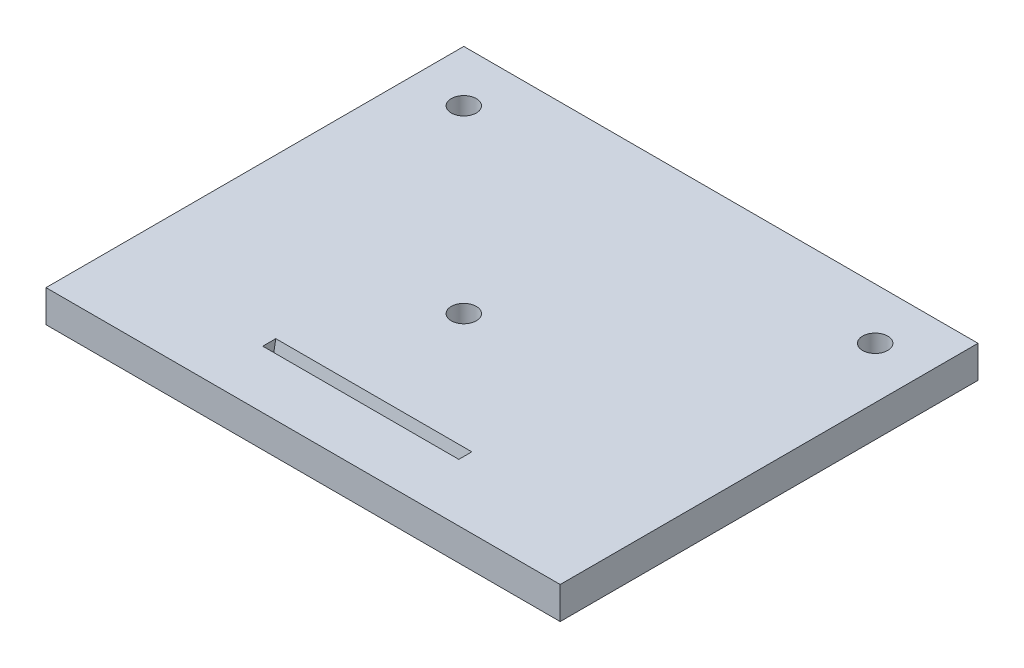
ISO-10303-21;
HEADER;
FILE_DESCRIPTION(('STEP AP214'),'2;1');
FILE_NAME('part.step','',(''),(''),'','','');
FILE_SCHEMA(('AUTOMOTIVE_DESIGN { 1 0 10303 214 1 1 1 1 }'));
ENDSEC;
DATA;
#1=APPLICATION_CONTEXT('core data for automotive mechanical design processes');
#2=APPLICATION_PROTOCOL_DEFINITION('international standard','automotive_design',2000,#1);
#3=PRODUCT_CONTEXT('',#1,'mechanical');
#4=PRODUCT('Part','Part','',(#3));
#5=PRODUCT_RELATED_PRODUCT_CATEGORY('part','',(#4));
#6=PRODUCT_DEFINITION_FORMATION('','',#4);
#7=PRODUCT_DEFINITION_CONTEXT('part definition',#1,'design');
#8=PRODUCT_DEFINITION('design','',#6,#7);
#9=PRODUCT_DEFINITION_SHAPE('','',#8);
#10=(LENGTH_UNIT() NAMED_UNIT(*) SI_UNIT(.MILLI.,.METRE.));
#11=(NAMED_UNIT(*) PLANE_ANGLE_UNIT() SI_UNIT($,.RADIAN.));
#12=(NAMED_UNIT(*) SI_UNIT($,.STERADIAN.) SOLID_ANGLE_UNIT());
#13=UNCERTAINTY_MEASURE_WITH_UNIT(LENGTH_MEASURE(1.E-05),#10,'distance_accuracy_value','');
#14=(GEOMETRIC_REPRESENTATION_CONTEXT(3) GLOBAL_UNCERTAINTY_ASSIGNED_CONTEXT((#13)) GLOBAL_UNIT_ASSIGNED_CONTEXT((#10,
#11,#12)) REPRESENTATION_CONTEXT('',''));
#15=CARTESIAN_POINT('',(0.,0.,0.));
#16=DIRECTION('',(0.,0.,1.));
#17=DIRECTION('',(1.,0.,0.));
#18=AXIS2_PLACEMENT_3D('',#15,#16,#17);
#19=CARTESIAN_POINT('',(0.,5.,0.));
#20=DIRECTION('',(0.,-1.,0.));
#21=DIRECTION('',(0.,0.,-1.));
#22=AXIS2_PLACEMENT_3D('',#19,#20,#21);
#23=PLANE('',#22);
#24=DIRECTION('',(0.,0.,1.));
#25=VECTOR('',#24,1.);
#26=CARTESIAN_POINT('',(0.,5.,0.));
#27=LINE('',#26,#25);
#28=CARTESIAN_POINT('',(0.,5.,-65.));
#29=VERTEX_POINT('',#28);
#30=CARTESIAN_POINT('',(0.,5.,0.));
#31=VERTEX_POINT('',#30);
#32=EDGE_CURVE('E139',#29,#31,#27,.T.);
#33=ORIENTED_EDGE('',*,*,#32,.T.);
#34=DIRECTION('',(1.,0.,0.));
#35=VECTOR('',#34,1.);
#36=CARTESIAN_POINT('',(0.,5.,0.));
#37=LINE('',#36,#35);
#38=CARTESIAN_POINT('',(80.,5.,0.));
#39=VERTEX_POINT('',#38);
#40=EDGE_CURVE('E142',#31,#39,#37,.T.);
#41=ORIENTED_EDGE('',*,*,#40,.T.);
#42=DIRECTION('',(0.,0.,-1.));
#43=VECTOR('',#42,1.);
#44=CARTESIAN_POINT('',(80.,5.,0.));
#45=LINE('',#44,#43);
#46=CARTESIAN_POINT('',(80.,5.,-65.));
#47=VERTEX_POINT('',#46);
#48=EDGE_CURVE('E145',#39,#47,#45,.T.);
#49=ORIENTED_EDGE('',*,*,#48,.T.);
#50=DIRECTION('',(-1.,0.,0.));
#51=VECTOR('',#50,1.);
#52=CARTESIAN_POINT('',(0.,5.,-65.));
#53=LINE('',#52,#51);
#54=EDGE_CURVE('E147',#47,#29,#53,.T.);
#55=ORIENTED_EDGE('',*,*,#54,.T.);
#56=EDGE_LOOP('',(#33,#41,#49,#55));
#57=FACE_BOUND('',#56,.T.);
#58=CARTESIAN_POINT('',(72.,5.,-57.));
#59=DIRECTION('',(0.,1.,0.));
#60=DIRECTION('',(0.,0.,1.));
#61=AXIS2_PLACEMENT_3D('',#58,#59,#60);
#62=CIRCLE('',#61,1.94999999999999);
#63=CARTESIAN_POINT('',(72.,5.,-55.05));
#64=VERTEX_POINT('',#63);
#65=EDGE_CURVE('E132',#64,#64,#62,.T.);
#66=ORIENTED_EDGE('',*,*,#65,.F.);
#67=EDGE_LOOP('',(#66));
#68=FACE_BOUND('',#67,.T.);
#69=CARTESIAN_POINT('',(36.,5.,-29.));
#70=DIRECTION('',(0.,1.,0.));
#71=DIRECTION('',(0.,0.,1.));
#72=AXIS2_PLACEMENT_3D('',#69,#70,#71);
#73=CIRCLE('',#72,1.94999999999999);
#74=CARTESIAN_POINT('',(36.,5.,-27.05));
#75=VERTEX_POINT('',#74);
#76=EDGE_CURVE('E126',#75,#75,#73,.T.);
#77=ORIENTED_EDGE('',*,*,#76,.F.);
#78=EDGE_LOOP('',(#77));
#79=FACE_BOUND('',#78,.T.);
#80=CARTESIAN_POINT('',(8.,5.,-57.));
#81=DIRECTION('',(0.,1.,0.));
#82=DIRECTION('',(0.,0.,1.));
#83=AXIS2_PLACEMENT_3D('',#80,#81,#82);
#84=CIRCLE('',#83,1.94999999999999);
#85=CARTESIAN_POINT('',(8.,5.,-55.05));
#86=VERTEX_POINT('',#85);
#87=EDGE_CURVE('E120',#86,#86,#84,.T.);
#88=ORIENTED_EDGE('',*,*,#87,.F.);
#89=EDGE_LOOP('',(#88));
#90=FACE_BOUND('',#89,.T.);
#91=DIRECTION('',(0.,0.,1.));
#92=VECTOR('',#91,1.);
#93=CARTESIAN_POINT('',(24.75,5.,0.));
#94=LINE('',#93,#92);
#95=CARTESIAN_POINT('',(24.75,5.,-11.));
#96=VERTEX_POINT('',#95);
#97=CARTESIAN_POINT('',(24.75,5.,-8.9691467762285));
#98=VERTEX_POINT('',#97);
#99=EDGE_CURVE('E115',#96,#98,#94,.T.);
#100=ORIENTED_EDGE('',*,*,#99,.F.);
#101=DIRECTION('',(-1.,0.,0.));
#102=VECTOR('',#101,1.);
#103=CARTESIAN_POINT('',(0.,5.,-11.));
#104=LINE('',#103,#102);
#105=CARTESIAN_POINT('',(55.25,5.,-11.));
#106=VERTEX_POINT('',#105);
#107=EDGE_CURVE('E113',#106,#96,#104,.T.);
#108=ORIENTED_EDGE('',*,*,#107,.F.);
#109=DIRECTION('',(0.,0.,-1.));
#110=VECTOR('',#109,1.);
#111=CARTESIAN_POINT('',(55.25,5.,0.));
#112=LINE('',#111,#110);
#113=CARTESIAN_POINT('',(55.25,5.,-8.9691467762285));
#114=VERTEX_POINT('',#113);
#115=EDGE_CURVE('E100',#114,#106,#112,.T.);
#116=ORIENTED_EDGE('',*,*,#115,.F.);
#117=DIRECTION('',(1.,0.,0.));
#118=VECTOR('',#117,1.);
#119=CARTESIAN_POINT('',(0.,5.,-8.96914677622851));
#120=LINE('',#119,#118);
#121=EDGE_CURVE('E95',#98,#114,#120,.T.);
#122=ORIENTED_EDGE('',*,*,#121,.F.);
#123=EDGE_LOOP('',(#100,#108,#116,#122));
#124=FACE_BOUND('',#123,.T.);
#125=ADVANCED_FACE('F33',(#57,#68,#79,#90,#124),#23,.F.);
#126=CARTESIAN_POINT('',(0.,0.,0.));
#127=DIRECTION('',(0.,-1.,0.));
#128=DIRECTION('',(0.,0.,-1.));
#129=AXIS2_PLACEMENT_3D('',#126,#127,#128);
#130=PLANE('',#129);
#131=DIRECTION('',(0.,0.,1.));
#132=VECTOR('',#131,1.);
#133=CARTESIAN_POINT('',(0.,0.,0.));
#134=LINE('',#133,#132);
#135=CARTESIAN_POINT('',(0.,0.,-65.));
#136=VERTEX_POINT('',#135);
#137=CARTESIAN_POINT('',(0.,0.,0.));
#138=VERTEX_POINT('',#137);
#139=EDGE_CURVE('E138',#136,#138,#134,.T.);
#140=ORIENTED_EDGE('',*,*,#139,.F.);
#141=DIRECTION('',(-1.,0.,0.));
#142=VECTOR('',#141,1.);
#143=CARTESIAN_POINT('',(0.,0.,-65.));
#144=LINE('',#143,#142);
#145=CARTESIAN_POINT('',(80.,0.,-65.));
#146=VERTEX_POINT('',#145);
#147=EDGE_CURVE('E143',#146,#136,#144,.T.);
#148=ORIENTED_EDGE('',*,*,#147,.F.);
#149=DIRECTION('',(0.,0.,-1.));
#150=VECTOR('',#149,1.);
#151=CARTESIAN_POINT('',(80.,0.,0.));
#152=LINE('',#151,#150);
#153=CARTESIAN_POINT('',(80.,0.,0.));
#154=VERTEX_POINT('',#153);
#155=EDGE_CURVE('E154',#154,#146,#152,.T.);
#156=ORIENTED_EDGE('',*,*,#155,.F.);
#157=DIRECTION('',(1.,0.,0.));
#158=VECTOR('',#157,1.);
#159=CARTESIAN_POINT('',(0.,0.,0.));
#160=LINE('',#159,#158);
#161=EDGE_CURVE('E152',#138,#154,#160,.T.);
#162=ORIENTED_EDGE('',*,*,#161,.F.);
#163=EDGE_LOOP('',(#140,#148,#156,#162));
#164=FACE_BOUND('',#163,.T.);
#165=CARTESIAN_POINT('',(72.,0.,-57.));
#166=DIRECTION('',(0.,1.,0.));
#167=DIRECTION('',(0.,0.,1.));
#168=AXIS2_PLACEMENT_3D('',#165,#166,#167);
#169=CIRCLE('',#168,1.94999999999999);
#170=CARTESIAN_POINT('',(72.,0.,-55.05));
#171=VERTEX_POINT('',#170);
#172=EDGE_CURVE('E135',#171,#171,#169,.T.);
#173=ORIENTED_EDGE('',*,*,#172,.T.);
#174=EDGE_LOOP('',(#173));
#175=FACE_BOUND('',#174,.T.);
#176=CARTESIAN_POINT('',(36.,0.,-29.));
#177=DIRECTION('',(0.,1.,0.));
#178=DIRECTION('',(0.,0.,1.));
#179=AXIS2_PLACEMENT_3D('',#176,#177,#178);
#180=CIRCLE('',#179,1.95);
#181=CARTESIAN_POINT('',(36.,0.,-27.05));
#182=VERTEX_POINT('',#181);
#183=EDGE_CURVE('E129',#182,#182,#180,.T.);
#184=ORIENTED_EDGE('',*,*,#183,.T.);
#185=EDGE_LOOP('',(#184));
#186=FACE_BOUND('',#185,.T.);
#187=CARTESIAN_POINT('',(8.,0.,-57.));
#188=DIRECTION('',(0.,1.,0.));
#189=DIRECTION('',(0.,0.,1.));
#190=AXIS2_PLACEMENT_3D('',#187,#188,#189);
#191=CIRCLE('',#190,1.95);
#192=CARTESIAN_POINT('',(8.,0.,-55.05));
#193=VERTEX_POINT('',#192);
#194=EDGE_CURVE('E123',#193,#193,#191,.T.);
#195=ORIENTED_EDGE('',*,*,#194,.T.);
#196=EDGE_LOOP('',(#195));
#197=FACE_BOUND('',#196,.T.);
#198=DIRECTION('',(-1.,0.,0.));
#199=VECTOR('',#198,1.);
#200=CARTESIAN_POINT('',(0.,0.,-10.1183650964577));
#201=LINE('',#200,#199);
#202=CARTESIAN_POINT('',(55.25,0.,-10.1183650964577));
#203=VERTEX_POINT('',#202);
#204=CARTESIAN_POINT('',(24.75,0.,-10.1183650964577));
#205=VERTEX_POINT('',#204);
#206=EDGE_CURVE('E41',#203,#205,#201,.T.);
#207=ORIENTED_EDGE('',*,*,#206,.T.);
#208=DIRECTION('',(0.,0.,1.));
#209=VECTOR('',#208,1.);
#210=CARTESIAN_POINT('',(24.75,0.,0.));
#211=LINE('',#210,#209);
#212=CARTESIAN_POINT('',(24.75,0.,-8.08751187268618));
#213=VERTEX_POINT('',#212);
#214=EDGE_CURVE('E11',#205,#213,#211,.T.);
#215=ORIENTED_EDGE('',*,*,#214,.T.);
#216=DIRECTION('',(1.,0.,0.));
#217=VECTOR('',#216,1.);
#218=CARTESIAN_POINT('',(0.,0.,-8.08751187268618));
#219=LINE('',#218,#217);
#220=CARTESIAN_POINT('',(55.25,0.,-8.08751187268618));
#221=VERTEX_POINT('',#220);
#222=EDGE_CURVE('E168',#213,#221,#219,.T.);
#223=ORIENTED_EDGE('',*,*,#222,.T.);
#224=DIRECTION('',(0.,0.,-1.));
#225=VECTOR('',#224,1.);
#226=CARTESIAN_POINT('',(55.25,0.,0.));
#227=LINE('',#226,#225);
#228=EDGE_CURVE('E108',#221,#203,#227,.T.);
#229=ORIENTED_EDGE('',*,*,#228,.T.);
#230=EDGE_LOOP('',(#207,#215,#223,#229));
#231=FACE_BOUND('',#230,.T.);
#232=ADVANCED_FACE('F172',(#164,#175,#186,#197,#231),#130,.T.);
#233=CARTESIAN_POINT('',(0.,5.,0.));
#234=DIRECTION('',(1.,0.,0.));
#235=DIRECTION('',(0.,0.,-1.));
#236=AXIS2_PLACEMENT_3D('',#233,#234,#235);
#237=PLANE('',#236);
#238=ORIENTED_EDGE('',*,*,#139,.T.);
#239=DIRECTION('',(0.,-1.,0.));
#240=VECTOR('',#239,1.);
#241=CARTESIAN_POINT('',(0.,5.,0.));
#242=LINE('',#241,#240);
#243=EDGE_CURVE('E165',#31,#138,#242,.T.);
#244=ORIENTED_EDGE('',*,*,#243,.F.);
#245=ORIENTED_EDGE('',*,*,#32,.F.);
#246=DIRECTION('',(0.,-1.,0.));
#247=VECTOR('',#246,1.);
#248=CARTESIAN_POINT('',(0.,5.,-65.));
#249=LINE('',#248,#247);
#250=EDGE_CURVE('E149',#29,#136,#249,.T.);
#251=ORIENTED_EDGE('',*,*,#250,.T.);
#252=EDGE_LOOP('',(#238,#244,#245,#251));
#253=FACE_BOUND('',#252,.T.);
#254=ADVANCED_FACE('F35',(#253),#237,.F.);
#255=CARTESIAN_POINT('',(0.,5.,0.));
#256=DIRECTION('',(0.,0.,-1.));
#257=DIRECTION('',(-1.,0.,0.));
#258=AXIS2_PLACEMENT_3D('',#255,#256,#257);
#259=PLANE('',#258);
#260=ORIENTED_EDGE('',*,*,#161,.T.);
#261=DIRECTION('',(0.,-1.,0.));
#262=VECTOR('',#261,1.);
#263=CARTESIAN_POINT('',(80.,5.,0.));
#264=LINE('',#263,#262);
#265=EDGE_CURVE('E162',#39,#154,#264,.T.);
#266=ORIENTED_EDGE('',*,*,#265,.F.);
#267=ORIENTED_EDGE('',*,*,#40,.F.);
#268=ORIENTED_EDGE('',*,*,#243,.T.);
#269=EDGE_LOOP('',(#260,#266,#267,#268));
#270=FACE_BOUND('',#269,.T.);
#271=ADVANCED_FACE('F211',(#270),#259,.F.);
#272=CARTESIAN_POINT('',(80.,5.,0.));
#273=DIRECTION('',(-1.,0.,0.));
#274=DIRECTION('',(0.,0.,1.));
#275=AXIS2_PLACEMENT_3D('',#272,#273,#274);
#276=PLANE('',#275);
#277=ORIENTED_EDGE('',*,*,#155,.T.);
#278=DIRECTION('',(0.,-1.,0.));
#279=VECTOR('',#278,1.);
#280=CARTESIAN_POINT('',(80.,5.,-65.));
#281=LINE('',#280,#279);
#282=EDGE_CURVE('E159',#47,#146,#281,.T.);
#283=ORIENTED_EDGE('',*,*,#282,.F.);
#284=ORIENTED_EDGE('',*,*,#48,.F.);
#285=ORIENTED_EDGE('',*,*,#265,.T.);
#286=EDGE_LOOP('',(#277,#283,#284,#285));
#287=FACE_BOUND('',#286,.T.);
#288=ADVANCED_FACE('F208',(#287),#276,.F.);
#289=CARTESIAN_POINT('',(0.,5.,-65.));
#290=DIRECTION('',(0.,0.,1.));
#291=DIRECTION('',(1.,0.,0.));
#292=AXIS2_PLACEMENT_3D('',#289,#290,#291);
#293=PLANE('',#292);
#294=ORIENTED_EDGE('',*,*,#147,.T.);
#295=ORIENTED_EDGE('',*,*,#250,.F.);
#296=ORIENTED_EDGE('',*,*,#54,.F.);
#297=ORIENTED_EDGE('',*,*,#282,.T.);
#298=EDGE_LOOP('',(#294,#295,#296,#297));
#299=FACE_BOUND('',#298,.T.);
#300=ADVANCED_FACE('F205',(#299),#293,.F.);
#301=CARTESIAN_POINT('',(72.,5.,-57.));
#302=DIRECTION('',(0.,1.,0.));
#303=DIRECTION('',(0.,0.,1.));
#304=AXIS2_PLACEMENT_3D('',#301,#302,#303);
#305=CYLINDRICAL_SURFACE('',#304,1.94999999999999);
#306=ORIENTED_EDGE('',*,*,#172,.F.);
#307=EDGE_LOOP('',(#306));
#308=FACE_BOUND('',#307,.T.);
#309=ORIENTED_EDGE('',*,*,#65,.T.);
#310=EDGE_LOOP('',(#309));
#311=FACE_BOUND('',#310,.T.);
#312=ADVANCED_FACE('F202',(#308,#311),#305,.F.);
#313=CARTESIAN_POINT('',(36.,5.,-29.));
#314=DIRECTION('',(0.,1.,0.));
#315=DIRECTION('',(0.,0.,1.));
#316=AXIS2_PLACEMENT_3D('',#313,#314,#315);
#317=CYLINDRICAL_SURFACE('',#316,1.94999999999999);
#318=ORIENTED_EDGE('',*,*,#183,.F.);
#319=EDGE_LOOP('',(#318));
#320=FACE_BOUND('',#319,.T.);
#321=ORIENTED_EDGE('',*,*,#76,.T.);
#322=EDGE_LOOP('',(#321));
#323=FACE_BOUND('',#322,.T.);
#324=ADVANCED_FACE('F189',(#320,#323),#317,.F.);
#325=CARTESIAN_POINT('',(8.,5.,-57.));
#326=DIRECTION('',(0.,1.,0.));
#327=DIRECTION('',(0.,0.,1.));
#328=AXIS2_PLACEMENT_3D('',#325,#326,#327);
#329=CYLINDRICAL_SURFACE('',#328,1.94999999999999);
#330=ORIENTED_EDGE('',*,*,#194,.F.);
#331=EDGE_LOOP('',(#330));
#332=FACE_BOUND('',#331,.T.);
#333=ORIENTED_EDGE('',*,*,#87,.T.);
#334=EDGE_LOOP('',(#333));
#335=FACE_BOUND('',#334,.T.);
#336=ADVANCED_FACE('F182',(#332,#335),#329,.F.);
#337=CARTESIAN_POINT('',(24.75,-1.73034234025595,-9.81325905600832));
#338=DIRECTION('',(1.,0.,0.));
#339=DIRECTION('',(0.,0.,-1.));
#340=AXIS2_PLACEMENT_3D('',#337,#338,#339);
#341=PLANE('',#340);
#342=ORIENTED_EDGE('',*,*,#99,.T.);
#343=DIRECTION('',(0.,0.984807753012208,-0.17364817766693));
#344=VECTOR('',#343,1.);
#345=CARTESIAN_POINT('',(24.75,-1.38304598492209,-7.8436435499839));
#346=LINE('',#345,#344);
#347=EDGE_CURVE('E48',#213,#98,#346,.T.);
#348=ORIENTED_EDGE('',*,*,#347,.F.);
#349=ORIENTED_EDGE('',*,*,#214,.F.);
#350=DIRECTION('',(0.,0.984807753012208,-0.17364817766693));
#351=VECTOR('',#350,1.);
#352=CARTESIAN_POINT('',(24.75,-1.73034234025595,-9.81325905600832));
#353=LINE('',#352,#351);
#354=EDGE_CURVE('E101',#205,#96,#353,.T.);
#355=ORIENTED_EDGE('',*,*,#354,.T.);
#356=EDGE_LOOP('',(#342,#348,#349,#355));
#357=FACE_BOUND('',#356,.T.);
#358=ADVANCED_FACE('F180',(#357),#341,.T.);
#359=CARTESIAN_POINT('',(24.75,-1.73034234025595,-9.81325905600832));
#360=DIRECTION('',(0.,0.17364817766693,0.984807753012208));
#361=DIRECTION('',(0.,-0.984807753012208,0.17364817766693));
#362=AXIS2_PLACEMENT_3D('',#359,#360,#361);
#363=PLANE('',#362);
#364=ORIENTED_EDGE('',*,*,#107,.T.);
#365=ORIENTED_EDGE('',*,*,#354,.F.);
#366=ORIENTED_EDGE('',*,*,#206,.F.);
#367=DIRECTION('',(0.,0.984807753012208,-0.17364817766693));
#368=VECTOR('',#367,1.);
#369=CARTESIAN_POINT('',(55.25,-1.73034234025595,-9.81325905600832));
#370=LINE('',#369,#368);
#371=EDGE_CURVE('E110',#203,#106,#370,.T.);
#372=ORIENTED_EDGE('',*,*,#371,.T.);
#373=EDGE_LOOP('',(#364,#365,#366,#372));
#374=FACE_BOUND('',#373,.T.);
#375=ADVANCED_FACE('F175',(#374),#363,.T.);
#376=CARTESIAN_POINT('',(55.25,-1.73034234025595,-9.81325905600832));
#377=DIRECTION('',(-1.,0.,0.));
#378=DIRECTION('',(0.,0.,1.));
#379=AXIS2_PLACEMENT_3D('',#376,#377,#378);
#380=PLANE('',#379);
#381=ORIENTED_EDGE('',*,*,#115,.T.);
#382=ORIENTED_EDGE('',*,*,#371,.F.);
#383=ORIENTED_EDGE('',*,*,#228,.F.);
#384=DIRECTION('',(0.,0.984807753012208,-0.17364817766693));
#385=VECTOR('',#384,1.);
#386=CARTESIAN_POINT('',(55.25,-1.38304598492209,-7.8436435499839));
#387=LINE('',#386,#385);
#388=EDGE_CURVE('E53',#221,#114,#387,.T.);
#389=ORIENTED_EDGE('',*,*,#388,.T.);
#390=EDGE_LOOP('',(#381,#382,#383,#389));
#391=FACE_BOUND('',#390,.T.);
#392=ADVANCED_FACE('F104',(#391),#380,.T.);
#393=CARTESIAN_POINT('',(24.75,-1.38304598492209,-7.8436435499839));
#394=DIRECTION('',(0.,-0.17364817766693,-0.984807753012208));
#395=DIRECTION('',(0.,0.984807753012208,-0.17364817766693));
#396=AXIS2_PLACEMENT_3D('',#393,#394,#395);
#397=PLANE('',#396);
#398=ORIENTED_EDGE('',*,*,#121,.T.);
#399=ORIENTED_EDGE('',*,*,#388,.F.);
#400=ORIENTED_EDGE('',*,*,#222,.F.);
#401=ORIENTED_EDGE('',*,*,#347,.T.);
#402=EDGE_LOOP('',(#398,#399,#400,#401));
#403=FACE_BOUND('',#402,.T.);
#404=ADVANCED_FACE('F96',(#403),#397,.T.);
#405=CLOSED_SHELL('',(#125,#232,#254,#271,#288,#300,#312,#324,#336,#358,#375,#392,#404));
#406=MANIFOLD_SOLID_BREP('B2',#405);
#407=ADVANCED_BREP_SHAPE_REPRESENTATION('',(#18,#406),#14);
#408=SHAPE_DEFINITION_REPRESENTATION(#9,#407);
ENDSEC;
END-ISO-10303-21;
